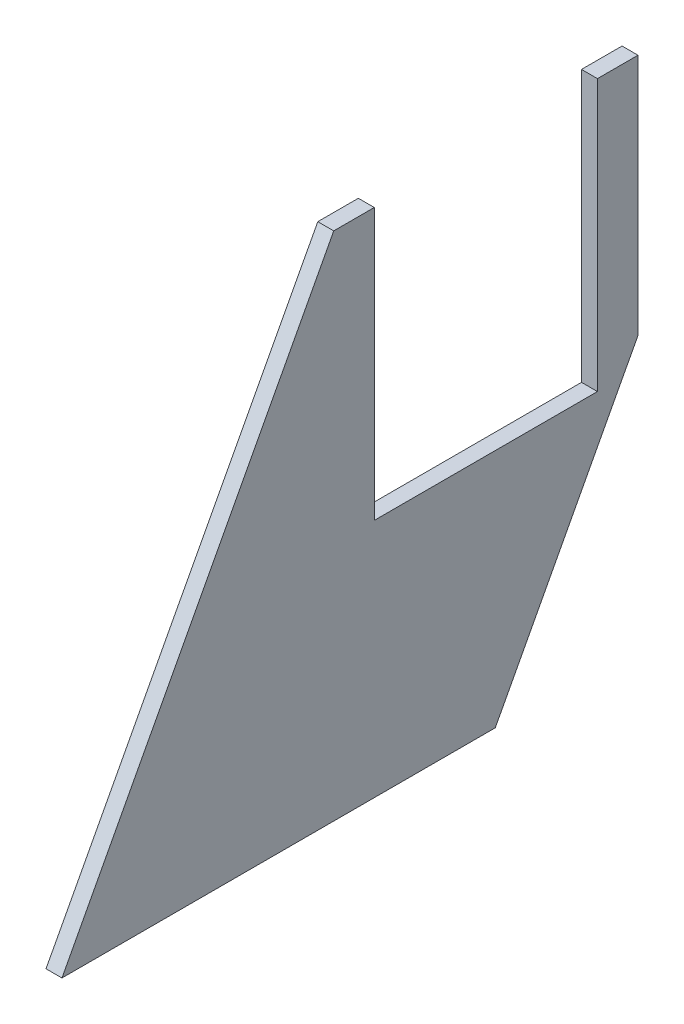
ISO-10303-21;
HEADER;
FILE_DESCRIPTION(('STEP AP214'),'2;1');
FILE_NAME('part.step','',(''),(''),'','','');
FILE_SCHEMA(('AUTOMOTIVE_DESIGN { 1 0 10303 214 1 1 1 1 }'));
ENDSEC;
DATA;
#1=APPLICATION_CONTEXT('core data for automotive mechanical design processes');
#2=APPLICATION_PROTOCOL_DEFINITION('international standard','automotive_design',2000,#1);
#3=PRODUCT_CONTEXT('',#1,'mechanical');
#4=PRODUCT('Part','Part','',(#3));
#5=PRODUCT_RELATED_PRODUCT_CATEGORY('part','',(#4));
#6=PRODUCT_DEFINITION_FORMATION('','',#4);
#7=PRODUCT_DEFINITION_CONTEXT('part definition',#1,'design');
#8=PRODUCT_DEFINITION('design','',#6,#7);
#9=PRODUCT_DEFINITION_SHAPE('','',#8);
#10=(LENGTH_UNIT() NAMED_UNIT(*) SI_UNIT(.MILLI.,.METRE.));
#11=(NAMED_UNIT(*) PLANE_ANGLE_UNIT() SI_UNIT($,.RADIAN.));
#12=(NAMED_UNIT(*) SI_UNIT($,.STERADIAN.) SOLID_ANGLE_UNIT());
#13=UNCERTAINTY_MEASURE_WITH_UNIT(LENGTH_MEASURE(1.E-05),#10,'distance_accuracy_value','');
#14=(GEOMETRIC_REPRESENTATION_CONTEXT(3) GLOBAL_UNCERTAINTY_ASSIGNED_CONTEXT((#13)) GLOBAL_UNIT_ASSIGNED_CONTEXT((#10,
#11,#12)) REPRESENTATION_CONTEXT('',''));
#15=CARTESIAN_POINT('',(0.,0.,0.));
#16=DIRECTION('',(0.,0.,1.));
#17=DIRECTION('',(1.,0.,0.));
#18=AXIS2_PLACEMENT_3D('',#15,#16,#17);
#19=CARTESIAN_POINT('',(-43.65,-0.00999999999995449,-170.265974623788));
#20=DIRECTION('',(-1.,0.,0.));
#21=DIRECTION('',(0.,0.,1.));
#22=AXIS2_PLACEMENT_3D('',#19,#20,#21);
#23=PLANE('',#22);
#24=DIRECTION('',(0.,-1.,0.));
#25=VECTOR('',#24,1.);
#26=CARTESIAN_POINT('',(-43.65,203.6,-143.154202423773));
#27=LINE('',#26,#25);
#28=CARTESIAN_POINT('',(-43.65,203.6,-143.154202423773));
#29=VERTEX_POINT('',#28);
#30=CARTESIAN_POINT('',(-43.65,106.923746647894,-143.154202423773));
#31=VERTEX_POINT('',#30);
#32=EDGE_CURVE('E148',#29,#31,#27,.T.);
#33=ORIENTED_EDGE('',*,*,#32,.F.);
#34=DIRECTION('',(0.,0.,1.));
#35=VECTOR('',#34,1.);
#36=CARTESIAN_POINT('',(-43.65,203.6,0.));
#37=LINE('',#36,#35);
#38=CARTESIAN_POINT('',(-43.65,203.6,-127.004202423773));
#39=VERTEX_POINT('',#38);
#40=EDGE_CURVE('E172',#29,#39,#37,.T.);
#41=ORIENTED_EDGE('',*,*,#40,.T.);
#42=DIRECTION('',(0.,-1.,0.));
#43=VECTOR('',#42,1.);
#44=CARTESIAN_POINT('',(-43.65,0.,-127.004202423773));
#45=LINE('',#44,#43);
#46=CARTESIAN_POINT('',(-43.65,95.6500000000001,-127.004202423773));
#47=VERTEX_POINT('',#46);
#48=EDGE_CURVE('E175',#39,#47,#45,.T.);
#49=ORIENTED_EDGE('',*,*,#48,.T.);
#50=DIRECTION('',(0.,0.,1.));
#51=VECTOR('',#50,1.);
#52=CARTESIAN_POINT('',(-43.65,95.65,0.));
#53=LINE('',#52,#51);
#54=CARTESIAN_POINT('',(-43.65,95.6500000000001,-38.1042024237734));
#55=VERTEX_POINT('',#54);
#56=EDGE_CURVE('E162',#47,#55,#53,.T.);
#57=ORIENTED_EDGE('',*,*,#56,.T.);
#58=DIRECTION('',(0.,1.,0.));
#59=VECTOR('',#58,1.);
#60=CARTESIAN_POINT('',(-43.65,0.,-38.1042024237734));
#61=LINE('',#60,#59);
#62=CARTESIAN_POINT('',(-43.65,203.6,-38.1042024237733));
#63=VERTEX_POINT('',#62);
#64=EDGE_CURVE('E160',#55,#63,#61,.T.);
#65=ORIENTED_EDGE('',*,*,#64,.T.);
#66=DIRECTION('',(0.,0.,1.));
#67=VECTOR('',#66,1.);
#68=CARTESIAN_POINT('',(-43.65,203.6,2.5115711979298E-13));
#69=LINE('',#68,#67);
#70=CARTESIAN_POINT('',(-43.65,203.6,-21.9542024237733));
#71=VERTEX_POINT('',#70);
#72=EDGE_CURVE('E120',#63,#71,#69,.T.);
#73=ORIENTED_EDGE('',*,*,#72,.T.);
#74=DIRECTION('',(0.,0.882947592858925,-0.469471562785895));
#75=VECTOR('',#74,1.);
#76=CARTESIAN_POINT('',(-43.65,0.,86.301837862505));
#77=LINE('',#76,#75);
#78=CARTESIAN_POINT('',(-43.65,0.,86.301837862505));
#79=VERTEX_POINT('',#78);
#80=EDGE_CURVE('E124',#79,#71,#77,.T.);
#81=ORIENTED_EDGE('',*,*,#80,.F.);
#82=DIRECTION('',(0.,0.,-1.));
#83=VECTOR('',#82,1.);
#84=CARTESIAN_POINT('',(-43.65,0.,0.));
#85=LINE('',#84,#83);
#86=CARTESIAN_POINT('',(-43.65,0.,-86.3018378625049));
#87=VERTEX_POINT('',#86);
#88=EDGE_CURVE('E109',#79,#87,#85,.T.);
#89=ORIENTED_EDGE('',*,*,#88,.T.);
#90=DIRECTION('',(0.,-0.882947592858925,0.469471562785895));
#91=VECTOR('',#90,1.);
#92=CARTESIAN_POINT('',(-43.65,106.923746647894,-143.154202423773));
#93=LINE('',#92,#91);
#94=EDGE_CURVE('E128',#31,#87,#93,.T.);
#95=ORIENTED_EDGE('',*,*,#94,.F.);
#96=EDGE_LOOP('',(#33,#41,#49,#57,#65,#73,#81,#89,#95));
#97=FACE_BOUND('',#96,.T.);
#98=ADVANCED_FACE('F36',(#97),#23,.F.);
#99=CARTESIAN_POINT('',(-67.585,95.6500000000001,-127.004202423773));
#100=DIRECTION('',(0.,-1.,0.));
#101=DIRECTION('',(0.,0.,-1.));
#102=AXIS2_PLACEMENT_3D('',#99,#100,#101);
#103=PLANE('',#102);
#104=DIRECTION('',(1.,0.,0.));
#105=VECTOR('',#104,1.);
#106=CARTESIAN_POINT('',(-67.585,95.6500000000001,-127.004202423773));
#107=LINE('',#106,#105);
#108=CARTESIAN_POINT('',(-50.,95.6500000000001,-127.004202423773));
#109=VERTEX_POINT('',#108);
#110=EDGE_CURVE('E142',#109,#47,#107,.T.);
#111=ORIENTED_EDGE('',*,*,#110,.F.);
#112=DIRECTION('',(0.,0.,1.));
#113=VECTOR('',#112,1.);
#114=CARTESIAN_POINT('',(-50.,95.6500000000001,0.));
#115=LINE('',#114,#113);
#116=CARTESIAN_POINT('',(-50.,95.6500000000001,-38.1042024237734));
#117=VERTEX_POINT('',#116);
#118=EDGE_CURVE('E139',#109,#117,#115,.T.);
#119=ORIENTED_EDGE('',*,*,#118,.T.);
#120=DIRECTION('',(1.,0.,0.));
#121=VECTOR('',#120,1.);
#122=CARTESIAN_POINT('',(-67.585,95.6500000000001,-38.1042024237734));
#123=LINE('',#122,#121);
#124=EDGE_CURVE('E40',#117,#55,#123,.T.);
#125=ORIENTED_EDGE('',*,*,#124,.T.);
#126=ORIENTED_EDGE('',*,*,#56,.F.);
#127=EDGE_LOOP('',(#111,#119,#125,#126));
#128=FACE_BOUND('',#127,.T.);
#129=ADVANCED_FACE('F204',(#128),#103,.F.);
#130=CARTESIAN_POINT('',(50.,106.923746647894,-143.154202423773));
#131=DIRECTION('',(0.,0.469471562785895,0.882947592858925));
#132=DIRECTION('',(0.,-0.882947592858925,0.469471562785895));
#133=AXIS2_PLACEMENT_3D('',#130,#131,#132);
#134=PLANE('',#133);
#135=DIRECTION('',(-1.,0.,0.));
#136=VECTOR('',#135,1.);
#137=CARTESIAN_POINT('',(50.,106.923746647894,-143.154202423773));
#138=LINE('',#137,#136);
#139=CARTESIAN_POINT('',(-50.,106.923746647894,-143.154202423773));
#140=VERTEX_POINT('',#139);
#141=EDGE_CURVE('E134',#31,#140,#138,.T.);
#142=ORIENTED_EDGE('',*,*,#141,.F.);
#143=ORIENTED_EDGE('',*,*,#94,.T.);
#144=DIRECTION('',(-1.,0.,0.));
#145=VECTOR('',#144,1.);
#146=CARTESIAN_POINT('',(50.,0.,-86.3018378625049));
#147=LINE('',#146,#145);
#148=CARTESIAN_POINT('',(-50.,0.,-86.3018378625049));
#149=VERTEX_POINT('',#148);
#150=EDGE_CURVE('E116',#87,#149,#147,.T.);
#151=ORIENTED_EDGE('',*,*,#150,.T.);
#152=DIRECTION('',(0.,0.882947592858925,-0.469471562785895));
#153=VECTOR('',#152,1.);
#154=CARTESIAN_POINT('',(-50.,106.923746647894,-143.154202423773));
#155=LINE('',#154,#153);
#156=EDGE_CURVE('E121',#149,#140,#155,.T.);
#157=ORIENTED_EDGE('',*,*,#156,.T.);
#158=EDGE_LOOP('',(#142,#143,#151,#157));
#159=FACE_BOUND('',#158,.T.);
#160=ADVANCED_FACE('F195',(#159),#134,.F.);
#161=CARTESIAN_POINT('',(-50.01,203.6,-127.004202423773));
#162=DIRECTION('',(0.,0.,-1.));
#163=DIRECTION('',(-1.,0.,0.));
#164=AXIS2_PLACEMENT_3D('',#161,#162,#163);
#165=PLANE('',#164);
#166=DIRECTION('',(0.,-1.,0.));
#167=VECTOR('',#166,1.);
#168=CARTESIAN_POINT('',(-50.,0.,-127.004202423773));
#169=LINE('',#168,#167);
#170=CARTESIAN_POINT('',(-50.,203.6,-127.004202423773));
#171=VERTEX_POINT('',#170);
#172=EDGE_CURVE('E11',#171,#109,#169,.T.);
#173=ORIENTED_EDGE('',*,*,#172,.T.);
#174=ORIENTED_EDGE('',*,*,#110,.T.);
#175=ORIENTED_EDGE('',*,*,#48,.F.);
#176=DIRECTION('',(1.,0.,0.));
#177=VECTOR('',#176,1.);
#178=CARTESIAN_POINT('',(-50.01,203.6,-127.004202423773));
#179=LINE('',#178,#177);
#180=EDGE_CURVE('E60',#171,#39,#179,.T.);
#181=ORIENTED_EDGE('',*,*,#180,.F.);
#182=EDGE_LOOP('',(#173,#174,#175,#181));
#183=FACE_BOUND('',#182,.T.);
#184=ADVANCED_FACE('F193',(#183),#165,.F.);
#185=CARTESIAN_POINT('',(-50.,0.,0.));
#186=DIRECTION('',(-1.,0.,0.));
#187=DIRECTION('',(0.,0.,1.));
#188=AXIS2_PLACEMENT_3D('',#185,#186,#187);
#189=PLANE('',#188);
#190=ORIENTED_EDGE('',*,*,#118,.F.);
#191=ORIENTED_EDGE('',*,*,#172,.F.);
#192=DIRECTION('',(0.,0.,1.));
#193=VECTOR('',#192,1.);
#194=CARTESIAN_POINT('',(-50.,203.6,-120.654202423773));
#195=LINE('',#194,#193);
#196=CARTESIAN_POINT('',(-50.,203.6,-143.154202423773));
#197=VERTEX_POINT('',#196);
#198=EDGE_CURVE('E158',#197,#171,#195,.T.);
#199=ORIENTED_EDGE('',*,*,#198,.F.);
#200=DIRECTION('',(0.,1.,0.));
#201=VECTOR('',#200,1.);
#202=CARTESIAN_POINT('',(-50.,203.6,-143.154202423773));
#203=LINE('',#202,#201);
#204=EDGE_CURVE('E166',#140,#197,#203,.T.);
#205=ORIENTED_EDGE('',*,*,#204,.F.);
#206=ORIENTED_EDGE('',*,*,#156,.F.);
#207=DIRECTION('',(0.,0.,-1.));
#208=VECTOR('',#207,1.);
#209=CARTESIAN_POINT('',(-50.,0.,-86.3018378625049));
#210=LINE('',#209,#208);
#211=CARTESIAN_POINT('',(-50.,0.,86.301837862505));
#212=VERTEX_POINT('',#211);
#213=EDGE_CURVE('E135',#212,#149,#210,.T.);
#214=ORIENTED_EDGE('',*,*,#213,.F.);
#215=DIRECTION('',(0.,-0.882947592858925,0.469471562785895));
#216=VECTOR('',#215,1.);
#217=CARTESIAN_POINT('',(-50.,0.,86.301837862505));
#218=LINE('',#217,#216);
#219=CARTESIAN_POINT('',(-50.,203.6,-21.9542024237733));
#220=VERTEX_POINT('',#219);
#221=EDGE_CURVE('E132',#220,#212,#218,.T.);
#222=ORIENTED_EDGE('',*,*,#221,.F.);
#223=DIRECTION('',(0.,0.,1.));
#224=VECTOR('',#223,1.);
#225=CARTESIAN_POINT('',(-50.,203.6,-21.9542024237733));
#226=LINE('',#225,#224);
#227=CARTESIAN_POINT('',(-50.,203.6,-38.1042024237733));
#228=VERTEX_POINT('',#227);
#229=EDGE_CURVE('E156',#228,#220,#226,.T.);
#230=ORIENTED_EDGE('',*,*,#229,.F.);
#231=DIRECTION('',(0.,1.,0.));
#232=VECTOR('',#231,1.);
#233=CARTESIAN_POINT('',(-50.,0.,-38.1042024237733));
#234=LINE('',#233,#232);
#235=EDGE_CURVE('E45',#117,#228,#234,.T.);
#236=ORIENTED_EDGE('',*,*,#235,.F.);
#237=EDGE_LOOP('',(#190,#191,#199,#205,#206,#214,#222,#230,#236));
#238=FACE_BOUND('',#237,.T.);
#239=ADVANCED_FACE('F192',(#238),#189,.T.);
#240=CARTESIAN_POINT('',(-50.01,203.6,-38.1042024237733));
#241=DIRECTION('',(0.,0.,1.));
#242=DIRECTION('',(1.,0.,0.));
#243=AXIS2_PLACEMENT_3D('',#240,#241,#242);
#244=PLANE('',#243);
#245=ORIENTED_EDGE('',*,*,#235,.T.);
#246=DIRECTION('',(1.,0.,0.));
#247=VECTOR('',#246,1.);
#248=CARTESIAN_POINT('',(-50.01,203.6,-38.1042024237733));
#249=LINE('',#248,#247);
#250=EDGE_CURVE('E53',#228,#63,#249,.T.);
#251=ORIENTED_EDGE('',*,*,#250,.T.);
#252=ORIENTED_EDGE('',*,*,#64,.F.);
#253=ORIENTED_EDGE('',*,*,#124,.F.);
#254=EDGE_LOOP('',(#245,#251,#252,#253));
#255=FACE_BOUND('',#254,.T.);
#256=ADVANCED_FACE('F201',(#255),#244,.F.);
#257=CARTESIAN_POINT('',(50.,0.,86.301837862505));
#258=DIRECTION('',(0.,-0.469471562785895,-0.882947592858925));
#259=DIRECTION('',(0.,0.882947592858925,-0.469471562785895));
#260=AXIS2_PLACEMENT_3D('',#257,#258,#259);
#261=PLANE('',#260);
#262=DIRECTION('',(-1.,0.,0.));
#263=VECTOR('',#262,1.);
#264=CARTESIAN_POINT('',(50.,0.,86.301837862505));
#265=LINE('',#264,#263);
#266=EDGE_CURVE('E114',#79,#212,#265,.T.);
#267=ORIENTED_EDGE('',*,*,#266,.F.);
#268=ORIENTED_EDGE('',*,*,#80,.T.);
#269=DIRECTION('',(-1.,0.,0.));
#270=VECTOR('',#269,1.);
#271=CARTESIAN_POINT('',(50.,203.6,-21.9542024237733));
#272=LINE('',#271,#270);
#273=EDGE_CURVE('E183',#71,#220,#272,.T.);
#274=ORIENTED_EDGE('',*,*,#273,.T.);
#275=ORIENTED_EDGE('',*,*,#221,.T.);
#276=EDGE_LOOP('',(#267,#268,#274,#275));
#277=FACE_BOUND('',#276,.T.);
#278=ADVANCED_FACE('F130',(#277),#261,.F.);
#279=CARTESIAN_POINT('',(50.,203.6,-21.9542024237733));
#280=DIRECTION('',(0.,-1.,0.));
#281=DIRECTION('',(0.,0.,-1.));
#282=AXIS2_PLACEMENT_3D('',#279,#280,#281);
#283=PLANE('',#282);
#284=ORIENTED_EDGE('',*,*,#273,.F.);
#285=ORIENTED_EDGE('',*,*,#72,.F.);
#286=ORIENTED_EDGE('',*,*,#250,.F.);
#287=ORIENTED_EDGE('',*,*,#229,.T.);
#288=EDGE_LOOP('',(#284,#285,#286,#287));
#289=FACE_BOUND('',#288,.T.);
#290=ADVANCED_FACE('F223',(#289),#283,.F.);
#291=CARTESIAN_POINT('',(50.,203.6,-143.154202423773));
#292=DIRECTION('',(0.,0.,1.));
#293=DIRECTION('',(0.,-1.,0.));
#294=AXIS2_PLACEMENT_3D('',#291,#292,#293);
#295=PLANE('',#294);
#296=DIRECTION('',(-1.,0.,0.));
#297=VECTOR('',#296,1.);
#298=CARTESIAN_POINT('',(50.,203.6,-143.154202423773));
#299=LINE('',#298,#297);
#300=EDGE_CURVE('E137',#29,#197,#299,.T.);
#301=ORIENTED_EDGE('',*,*,#300,.F.);
#302=ORIENTED_EDGE('',*,*,#32,.T.);
#303=ORIENTED_EDGE('',*,*,#141,.T.);
#304=ORIENTED_EDGE('',*,*,#204,.T.);
#305=EDGE_LOOP('',(#301,#302,#303,#304));
#306=FACE_BOUND('',#305,.T.);
#307=ADVANCED_FACE('F187',(#306),#295,.F.);
#308=CARTESIAN_POINT('',(50.,203.6,-120.654202423773));
#309=DIRECTION('',(0.,-1.,0.));
#310=DIRECTION('',(0.,0.,-1.));
#311=AXIS2_PLACEMENT_3D('',#308,#309,#310);
#312=PLANE('',#311);
#313=ORIENTED_EDGE('',*,*,#40,.F.);
#314=ORIENTED_EDGE('',*,*,#300,.T.);
#315=ORIENTED_EDGE('',*,*,#198,.T.);
#316=ORIENTED_EDGE('',*,*,#180,.T.);
#317=EDGE_LOOP('',(#313,#314,#315,#316));
#318=FACE_BOUND('',#317,.T.);
#319=ADVANCED_FACE('F38',(#318),#312,.F.);
#320=CARTESIAN_POINT('',(-62.575,0.,-143.164202423773));
#321=DIRECTION('',(0.,-1.,0.));
#322=DIRECTION('',(1.,0.,0.));
#323=AXIS2_PLACEMENT_3D('',#320,#321,#322);
#324=PLANE('',#323);
#325=ORIENTED_EDGE('',*,*,#88,.F.);
#326=ORIENTED_EDGE('',*,*,#266,.T.);
#327=ORIENTED_EDGE('',*,*,#213,.T.);
#328=ORIENTED_EDGE('',*,*,#150,.F.);
#329=EDGE_LOOP('',(#325,#326,#327,#328));
#330=FACE_BOUND('',#329,.T.);
#331=ADVANCED_FACE('F111',(#330),#324,.T.);
#332=CLOSED_SHELL('',(#98,#129,#160,#184,#239,#256,#278,#290,#307,#319,#331));
#333=MANIFOLD_SOLID_BREP('B2',#332);
#334=ADVANCED_BREP_SHAPE_REPRESENTATION('',(#18,#333),#14);
#335=SHAPE_DEFINITION_REPRESENTATION(#9,#334);
ENDSEC;
END-ISO-10303-21;
